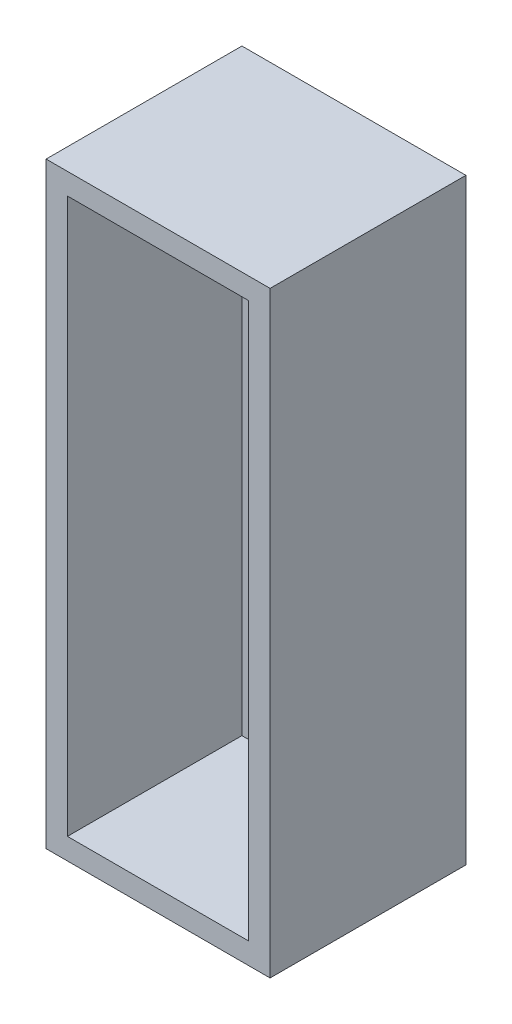
ISO-10303-21;
HEADER;
FILE_DESCRIPTION(('STEP AP214'),'2;1');
FILE_NAME('part.step','',(''),(''),'','','');
FILE_SCHEMA(('AUTOMOTIVE_DESIGN { 1 0 10303 214 1 1 1 1 }'));
ENDSEC;
DATA;
#1=APPLICATION_CONTEXT('core data for automotive mechanical design processes');
#2=APPLICATION_PROTOCOL_DEFINITION('international standard','automotive_design',2000,#1);
#3=PRODUCT_CONTEXT('',#1,'mechanical');
#4=PRODUCT('Part','Part','',(#3));
#5=PRODUCT_RELATED_PRODUCT_CATEGORY('part','',(#4));
#6=PRODUCT_DEFINITION_FORMATION('','',#4);
#7=PRODUCT_DEFINITION_CONTEXT('part definition',#1,'design');
#8=PRODUCT_DEFINITION('design','',#6,#7);
#9=PRODUCT_DEFINITION_SHAPE('','',#8);
#10=(LENGTH_UNIT() NAMED_UNIT(*) SI_UNIT(.MILLI.,.METRE.));
#11=(NAMED_UNIT(*) PLANE_ANGLE_UNIT() SI_UNIT($,.RADIAN.));
#12=(NAMED_UNIT(*) SI_UNIT($,.STERADIAN.) SOLID_ANGLE_UNIT());
#13=UNCERTAINTY_MEASURE_WITH_UNIT(LENGTH_MEASURE(1.E-05),#10,'distance_accuracy_value','');
#14=(GEOMETRIC_REPRESENTATION_CONTEXT(3) GLOBAL_UNCERTAINTY_ASSIGNED_CONTEXT((#13)) GLOBAL_UNIT_ASSIGNED_CONTEXT((#10,
#11,#12)) REPRESENTATION_CONTEXT('',''));
#15=CARTESIAN_POINT('',(0.,0.,0.));
#16=DIRECTION('',(0.,0.,1.));
#17=DIRECTION('',(1.,0.,0.));
#18=AXIS2_PLACEMENT_3D('',#15,#16,#17);
#19=CARTESIAN_POINT('',(0.,-12.7,12.7));
#20=DIRECTION('',(0.,1.,0.));
#21=DIRECTION('',(0.,0.,1.));
#22=AXIS2_PLACEMENT_3D('',#19,#20,#21);
#23=PLANE('',#22);
#24=DIRECTION('',(1.,0.,0.));
#25=VECTOR('',#24,1.);
#26=CARTESIAN_POINT('',(0.,-12.7,0.));
#27=LINE('',#26,#25);
#28=CARTESIAN_POINT('',(-12.7,-12.7,0.));
#29=VERTEX_POINT('',#28);
#30=CARTESIAN_POINT('',(120.65,-12.7,0.));
#31=VERTEX_POINT('',#30);
#32=EDGE_CURVE('E175',#29,#31,#27,.T.);
#33=ORIENTED_EDGE('',*,*,#32,.T.);
#34=DIRECTION('',(0.,0.,-1.));
#35=VECTOR('',#34,1.);
#36=CARTESIAN_POINT('',(120.65,-12.7,12.7));
#37=LINE('',#36,#35);
#38=CARTESIAN_POINT('',(120.65,-12.7,116.586));
#39=VERTEX_POINT('',#38);
#40=EDGE_CURVE('E11',#39,#31,#37,.T.);
#41=ORIENTED_EDGE('',*,*,#40,.F.);
#42=DIRECTION('',(1.,0.,0.));
#43=VECTOR('',#42,1.);
#44=CARTESIAN_POINT('',(-12.7,-12.7,116.586));
#45=LINE('',#44,#43);
#46=CARTESIAN_POINT('',(-12.7,-12.7,116.586));
#47=VERTEX_POINT('',#46);
#48=EDGE_CURVE('E152',#47,#39,#45,.T.);
#49=ORIENTED_EDGE('',*,*,#48,.F.);
#50=DIRECTION('',(0.,0.,-1.));
#51=VECTOR('',#50,1.);
#52=CARTESIAN_POINT('',(-12.7,-12.7,12.7));
#53=LINE('',#52,#51);
#54=EDGE_CURVE('E191',#47,#29,#53,.T.);
#55=ORIENTED_EDGE('',*,*,#54,.T.);
#56=EDGE_LOOP('',(#33,#41,#49,#55));
#57=FACE_BOUND('',#56,.T.);
#58=ADVANCED_FACE('F45',(#57),#23,.F.);
#59=CARTESIAN_POINT('',(120.65,0.,12.7));
#60=DIRECTION('',(-1.,0.,0.));
#61=DIRECTION('',(0.,0.,1.));
#62=AXIS2_PLACEMENT_3D('',#59,#60,#61);
#63=PLANE('',#62);
#64=DIRECTION('',(0.,1.,0.));
#65=VECTOR('',#64,1.);
#66=CARTESIAN_POINT('',(120.65,0.,0.));
#67=LINE('',#66,#65);
#68=CARTESIAN_POINT('',(120.65,342.9,0.));
#69=VERTEX_POINT('',#68);
#70=EDGE_CURVE('E179',#31,#69,#67,.T.);
#71=ORIENTED_EDGE('',*,*,#70,.T.);
#72=DIRECTION('',(0.,0.,-1.));
#73=VECTOR('',#72,1.);
#74=CARTESIAN_POINT('',(120.65,342.9,12.7));
#75=LINE('',#74,#73);
#76=CARTESIAN_POINT('',(120.65,342.9,116.586));
#77=VERTEX_POINT('',#76);
#78=EDGE_CURVE('E53',#77,#69,#75,.T.);
#79=ORIENTED_EDGE('',*,*,#78,.F.);
#80=DIRECTION('',(0.,1.,0.));
#81=VECTOR('',#80,1.);
#82=CARTESIAN_POINT('',(120.65,-12.7,116.586));
#83=LINE('',#82,#81);
#84=EDGE_CURVE('E156',#39,#77,#83,.T.);
#85=ORIENTED_EDGE('',*,*,#84,.F.);
#86=ORIENTED_EDGE('',*,*,#40,.T.);
#87=EDGE_LOOP('',(#71,#79,#85,#86));
#88=FACE_BOUND('',#87,.T.);
#89=ADVANCED_FACE('F203',(#88),#63,.F.);
#90=CARTESIAN_POINT('',(0.,342.9,12.7));
#91=DIRECTION('',(0.,1.,0.));
#92=DIRECTION('',(0.,0.,1.));
#93=AXIS2_PLACEMENT_3D('',#90,#91,#92);
#94=PLANE('',#93);
#95=DIRECTION('',(1.,0.,0.));
#96=VECTOR('',#95,1.);
#97=CARTESIAN_POINT('',(0.,342.9,0.));
#98=LINE('',#97,#96);
#99=CARTESIAN_POINT('',(-12.7,342.9,0.));
#100=VERTEX_POINT('',#99);
#101=EDGE_CURVE('E183',#100,#69,#98,.T.);
#102=ORIENTED_EDGE('',*,*,#101,.F.);
#103=DIRECTION('',(0.,0.,-1.));
#104=VECTOR('',#103,1.);
#105=CARTESIAN_POINT('',(-12.7,342.9,12.7));
#106=LINE('',#105,#104);
#107=CARTESIAN_POINT('',(-12.7,342.9,116.586));
#108=VERTEX_POINT('',#107);
#109=EDGE_CURVE('E194',#108,#100,#106,.T.);
#110=ORIENTED_EDGE('',*,*,#109,.F.);
#111=DIRECTION('',(-1.,0.,0.));
#112=VECTOR('',#111,1.);
#113=CARTESIAN_POINT('',(-12.7,342.9,116.586));
#114=LINE('',#113,#112);
#115=EDGE_CURVE('E160',#77,#108,#114,.T.);
#116=ORIENTED_EDGE('',*,*,#115,.F.);
#117=ORIENTED_EDGE('',*,*,#78,.T.);
#118=EDGE_LOOP('',(#102,#110,#116,#117));
#119=FACE_BOUND('',#118,.T.);
#120=ADVANCED_FACE('F200',(#119),#94,.T.);
#121=CARTESIAN_POINT('',(-12.7,0.,12.7));
#122=DIRECTION('',(-1.,0.,0.));
#123=DIRECTION('',(0.,0.,1.));
#124=AXIS2_PLACEMENT_3D('',#121,#122,#123);
#125=PLANE('',#124);
#126=DIRECTION('',(0.,1.,0.));
#127=VECTOR('',#126,1.);
#128=CARTESIAN_POINT('',(-12.7,0.,0.));
#129=LINE('',#128,#127);
#130=EDGE_CURVE('E187',#29,#100,#129,.T.);
#131=ORIENTED_EDGE('',*,*,#130,.F.);
#132=ORIENTED_EDGE('',*,*,#54,.F.);
#133=DIRECTION('',(0.,-1.,0.));
#134=VECTOR('',#133,1.);
#135=CARTESIAN_POINT('',(-12.7,-12.7,116.586));
#136=LINE('',#135,#134);
#137=EDGE_CURVE('E126',#108,#47,#136,.T.);
#138=ORIENTED_EDGE('',*,*,#137,.F.);
#139=ORIENTED_EDGE('',*,*,#109,.T.);
#140=EDGE_LOOP('',(#131,#132,#138,#139));
#141=FACE_BOUND('',#140,.T.);
#142=ADVANCED_FACE('F209',(#141),#125,.T.);
#143=CARTESIAN_POINT('',(0.,0.,0.));
#144=DIRECTION('',(0.,0.,1.));
#145=DIRECTION('',(1.,0.,0.));
#146=AXIS2_PLACEMENT_3D('',#143,#144,#145);
#147=PLANE('',#146);
#148=ORIENTED_EDGE('',*,*,#32,.F.);
#149=ORIENTED_EDGE('',*,*,#130,.T.);
#150=ORIENTED_EDGE('',*,*,#101,.T.);
#151=ORIENTED_EDGE('',*,*,#70,.F.);
#152=EDGE_LOOP('',(#148,#149,#150,#151));
#153=FACE_BOUND('',#152,.T.);
#154=ADVANCED_FACE('F206',(#153),#147,.F.);
#155=CARTESIAN_POINT('',(0.,0.,116.586));
#156=DIRECTION('',(0.,0.,-1.));
#157=DIRECTION('',(-1.,0.,0.));
#158=AXIS2_PLACEMENT_3D('',#155,#156,#157);
#159=PLANE('',#158);
#160=ORIENTED_EDGE('',*,*,#137,.T.);
#161=ORIENTED_EDGE('',*,*,#48,.T.);
#162=ORIENTED_EDGE('',*,*,#84,.T.);
#163=ORIENTED_EDGE('',*,*,#115,.T.);
#164=EDGE_LOOP('',(#160,#161,#162,#163));
#165=FACE_BOUND('',#164,.T.);
#166=DIRECTION('',(0.,-1.,0.));
#167=VECTOR('',#166,1.);
#168=CARTESIAN_POINT('',(0.,0.,116.586));
#169=LINE('',#168,#167);
#170=CARTESIAN_POINT('',(0.,330.2,116.586));
#171=VERTEX_POINT('',#170);
#172=CARTESIAN_POINT('',(0.,0.,116.586));
#173=VERTEX_POINT('',#172);
#174=EDGE_CURVE('E109',#171,#173,#169,.T.);
#175=ORIENTED_EDGE('',*,*,#174,.F.);
#176=DIRECTION('',(-1.,0.,0.));
#177=VECTOR('',#176,1.);
#178=CARTESIAN_POINT('',(0.,330.2,116.586));
#179=LINE('',#178,#177);
#180=CARTESIAN_POINT('',(107.95,330.2,116.586));
#181=VERTEX_POINT('',#180);
#182=EDGE_CURVE('E136',#181,#171,#179,.T.);
#183=ORIENTED_EDGE('',*,*,#182,.F.);
#184=DIRECTION('',(0.,1.,0.));
#185=VECTOR('',#184,1.);
#186=CARTESIAN_POINT('',(107.95,0.,116.586));
#187=LINE('',#186,#185);
#188=CARTESIAN_POINT('',(107.95,0.,116.586));
#189=VERTEX_POINT('',#188);
#190=EDGE_CURVE('E132',#189,#181,#187,.T.);
#191=ORIENTED_EDGE('',*,*,#190,.F.);
#192=DIRECTION('',(1.,0.,0.));
#193=VECTOR('',#192,1.);
#194=CARTESIAN_POINT('',(0.,0.,116.586));
#195=LINE('',#194,#193);
#196=EDGE_CURVE('E119',#173,#189,#195,.T.);
#197=ORIENTED_EDGE('',*,*,#196,.F.);
#198=EDGE_LOOP('',(#175,#183,#191,#197));
#199=FACE_BOUND('',#198,.T.);
#200=ADVANCED_FACE('F130',(#165,#199),#159,.F.);
#201=CARTESIAN_POINT('',(0.,0.,116.586));
#202=DIRECTION('',(1.,0.,0.));
#203=DIRECTION('',(0.,0.,-1.));
#204=AXIS2_PLACEMENT_3D('',#201,#202,#203);
#205=PLANE('',#204);
#206=DIRECTION('',(0.,0.,-1.));
#207=VECTOR('',#206,1.);
#208=CARTESIAN_POINT('',(0.,0.,116.586));
#209=LINE('',#208,#207);
#210=CARTESIAN_POINT('',(0.,0.,12.7));
#211=VERTEX_POINT('',#210);
#212=EDGE_CURVE('E112',#173,#211,#209,.T.);
#213=ORIENTED_EDGE('',*,*,#212,.T.);
#214=DIRECTION('',(0.,1.,0.));
#215=VECTOR('',#214,1.);
#216=CARTESIAN_POINT('',(0.,0.,12.7));
#217=LINE('',#216,#215);
#218=CARTESIAN_POINT('',(0.,330.2,12.7));
#219=VERTEX_POINT('',#218);
#220=EDGE_CURVE('E60',#211,#219,#217,.T.);
#221=ORIENTED_EDGE('',*,*,#220,.T.);
#222=DIRECTION('',(0.,0.,-1.));
#223=VECTOR('',#222,1.);
#224=CARTESIAN_POINT('',(0.,330.2,116.586));
#225=LINE('',#224,#223);
#226=EDGE_CURVE('E114',#171,#219,#225,.T.);
#227=ORIENTED_EDGE('',*,*,#226,.F.);
#228=ORIENTED_EDGE('',*,*,#174,.T.);
#229=EDGE_LOOP('',(#213,#221,#227,#228));
#230=FACE_BOUND('',#229,.T.);
#231=ADVANCED_FACE('F111',(#230),#205,.T.);
#232=CARTESIAN_POINT('',(0.,0.,116.586));
#233=DIRECTION('',(0.,1.,0.));
#234=DIRECTION('',(0.,0.,1.));
#235=AXIS2_PLACEMENT_3D('',#232,#233,#234);
#236=PLANE('',#235);
#237=DIRECTION('',(0.,0.,-1.));
#238=VECTOR('',#237,1.);
#239=CARTESIAN_POINT('',(107.95,0.,116.586));
#240=LINE('',#239,#238);
#241=CARTESIAN_POINT('',(107.95,0.,12.7));
#242=VERTEX_POINT('',#241);
#243=EDGE_CURVE('E127',#189,#242,#240,.T.);
#244=ORIENTED_EDGE('',*,*,#243,.T.);
#245=DIRECTION('',(-1.,0.,0.));
#246=VECTOR('',#245,1.);
#247=CARTESIAN_POINT('',(0.,0.,12.7));
#248=LINE('',#247,#246);
#249=EDGE_CURVE('E64',#242,#211,#248,.T.);
#250=ORIENTED_EDGE('',*,*,#249,.T.);
#251=ORIENTED_EDGE('',*,*,#212,.F.);
#252=ORIENTED_EDGE('',*,*,#196,.T.);
#253=EDGE_LOOP('',(#244,#250,#251,#252));
#254=FACE_BOUND('',#253,.T.);
#255=ADVANCED_FACE('F123',(#254),#236,.T.);
#256=CARTESIAN_POINT('',(107.95,0.,116.586));
#257=DIRECTION('',(-1.,0.,0.));
#258=DIRECTION('',(0.,0.,1.));
#259=AXIS2_PLACEMENT_3D('',#256,#257,#258);
#260=PLANE('',#259);
#261=DIRECTION('',(0.,0.,-1.));
#262=VECTOR('',#261,1.);
#263=CARTESIAN_POINT('',(107.95,330.2,116.586));
#264=LINE('',#263,#262);
#265=CARTESIAN_POINT('',(107.95,330.2,12.7));
#266=VERTEX_POINT('',#265);
#267=EDGE_CURVE('E143',#181,#266,#264,.T.);
#268=ORIENTED_EDGE('',*,*,#267,.T.);
#269=DIRECTION('',(0.,-1.,0.));
#270=VECTOR('',#269,1.);
#271=CARTESIAN_POINT('',(107.95,0.,12.7));
#272=LINE('',#271,#270);
#273=EDGE_CURVE('E168',#266,#242,#272,.T.);
#274=ORIENTED_EDGE('',*,*,#273,.T.);
#275=ORIENTED_EDGE('',*,*,#243,.F.);
#276=ORIENTED_EDGE('',*,*,#190,.T.);
#277=EDGE_LOOP('',(#268,#274,#275,#276));
#278=FACE_BOUND('',#277,.T.);
#279=ADVANCED_FACE('F237',(#278),#260,.T.);
#280=CARTESIAN_POINT('',(0.,330.2,116.586));
#281=DIRECTION('',(0.,-1.,0.));
#282=DIRECTION('',(0.,0.,-1.));
#283=AXIS2_PLACEMENT_3D('',#280,#281,#282);
#284=PLANE('',#283);
#285=ORIENTED_EDGE('',*,*,#226,.T.);
#286=DIRECTION('',(1.,0.,0.));
#287=VECTOR('',#286,1.);
#288=CARTESIAN_POINT('',(0.,330.2,12.7));
#289=LINE('',#288,#287);
#290=EDGE_CURVE('E164',#219,#266,#289,.T.);
#291=ORIENTED_EDGE('',*,*,#290,.T.);
#292=ORIENTED_EDGE('',*,*,#267,.F.);
#293=ORIENTED_EDGE('',*,*,#182,.T.);
#294=EDGE_LOOP('',(#285,#291,#292,#293));
#295=FACE_BOUND('',#294,.T.);
#296=ADVANCED_FACE('F230',(#295),#284,.T.);
#297=CARTESIAN_POINT('',(0.,0.,12.7));
#298=DIRECTION('',(0.,0.,1.));
#299=DIRECTION('',(1.,0.,0.));
#300=AXIS2_PLACEMENT_3D('',#297,#298,#299);
#301=PLANE('',#300);
#302=ORIENTED_EDGE('',*,*,#220,.F.);
#303=ORIENTED_EDGE('',*,*,#249,.F.);
#304=ORIENTED_EDGE('',*,*,#273,.F.);
#305=ORIENTED_EDGE('',*,*,#290,.F.);
#306=EDGE_LOOP('',(#302,#303,#304,#305));
#307=FACE_BOUND('',#306,.T.);
#308=ADVANCED_FACE('F227',(#307),#301,.T.);
#309=CLOSED_SHELL('',(#58,#89,#120,#142,#154,#200,#231,#255,#279,#296,#308));
#310=MANIFOLD_SOLID_BREP('B2',#309);
#311=ADVANCED_BREP_SHAPE_REPRESENTATION('',(#18,#310),#14);
#312=SHAPE_DEFINITION_REPRESENTATION(#9,#311);
ENDSEC;
END-ISO-10303-21;
